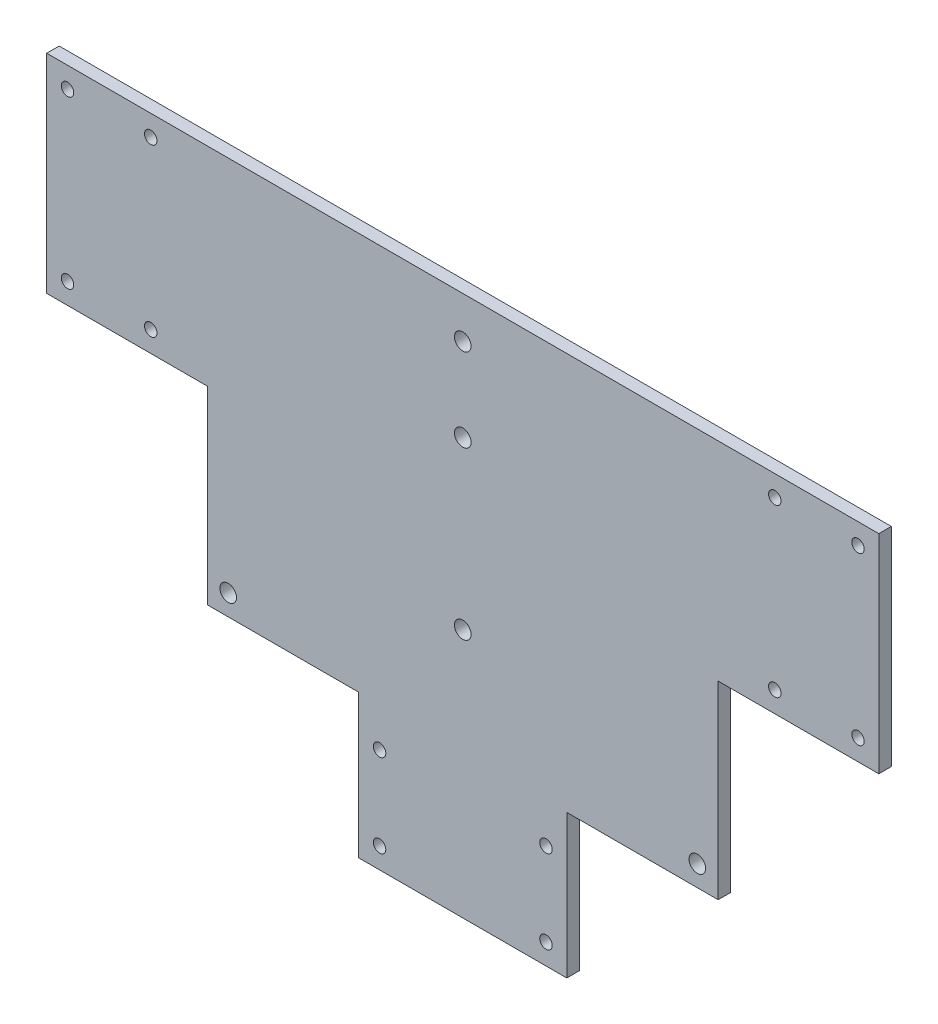
ISO-10303-21;
HEADER;
FILE_DESCRIPTION(('STEP AP214'),'2;1');
FILE_NAME('part.step','',(''),(''),'','','');
FILE_SCHEMA(('AUTOMOTIVE_DESIGN { 1 0 10303 214 1 1 1 1 }'));
ENDSEC;
DATA;
#1=APPLICATION_CONTEXT('core data for automotive mechanical design processes');
#2=APPLICATION_PROTOCOL_DEFINITION('international standard','automotive_design',2000,#1);
#3=PRODUCT_CONTEXT('',#1,'mechanical');
#4=PRODUCT('Part','Part','',(#3));
#5=PRODUCT_RELATED_PRODUCT_CATEGORY('part','',(#4));
#6=PRODUCT_DEFINITION_FORMATION('','',#4);
#7=PRODUCT_DEFINITION_CONTEXT('part definition',#1,'design');
#8=PRODUCT_DEFINITION('design','',#6,#7);
#9=PRODUCT_DEFINITION_SHAPE('','',#8);
#10=(LENGTH_UNIT() NAMED_UNIT(*) SI_UNIT(.MILLI.,.METRE.));
#11=(NAMED_UNIT(*) PLANE_ANGLE_UNIT() SI_UNIT($,.RADIAN.));
#12=(NAMED_UNIT(*) SI_UNIT($,.STERADIAN.) SOLID_ANGLE_UNIT());
#13=UNCERTAINTY_MEASURE_WITH_UNIT(LENGTH_MEASURE(1.E-05),#10,'distance_accuracy_value','');
#14=(GEOMETRIC_REPRESENTATION_CONTEXT(3) GLOBAL_UNCERTAINTY_ASSIGNED_CONTEXT((#13)) GLOBAL_UNIT_ASSIGNED_CONTEXT((#10,
#11,#12)) REPRESENTATION_CONTEXT('',''));
#15=CARTESIAN_POINT('',(0.,0.,0.));
#16=DIRECTION('',(0.,0.,1.));
#17=DIRECTION('',(1.,0.,0.));
#18=AXIS2_PLACEMENT_3D('',#15,#16,#17);
#19=CARTESIAN_POINT('',(100.,50.,3.));
#20=DIRECTION('',(0.,0.,-1.));
#21=DIRECTION('',(-1.,0.,0.));
#22=AXIS2_PLACEMENT_3D('',#19,#20,#21);
#23=PLANE('',#22);
#24=CARTESIAN_POINT('',(56.3815572471545,-40.5212085995402,3.));
#25=DIRECTION('',(0.,0.,1.));
#26=DIRECTION('',(-1.,0.,0.));
#27=AXIS2_PLACEMENT_3D('',#24,#25,#26);
#28=CIRCLE('',#27,2.00000000000002);
#29=CARTESIAN_POINT('',(54.3815572471545,-40.5212085995402,3.));
#30=VERTEX_POINT('',#29);
#31=EDGE_CURVE('E553',#30,#30,#28,.T.);
#32=ORIENTED_EDGE('',*,*,#31,.F.);
#33=EDGE_LOOP('',(#32));
#34=FACE_BOUND('',#33,.T.);
#35=CARTESIAN_POINT('',(75.,45.,3.));
#36=DIRECTION('',(0.,0.,1.));
#37=DIRECTION('',(1.,0.,0.));
#38=AXIS2_PLACEMENT_3D('',#35,#36,#37);
#39=CIRCLE('',#38,1.50000000000001);
#40=CARTESIAN_POINT('',(76.5,45.,3.));
#41=VERTEX_POINT('',#40);
#42=EDGE_CURVE('E565',#41,#41,#39,.T.);
#43=ORIENTED_EDGE('',*,*,#42,.F.);
#44=EDGE_LOOP('',(#43));
#45=FACE_BOUND('',#44,.T.);
#46=CARTESIAN_POINT('',(75.,5.,3.));
#47=DIRECTION('',(0.,0.,1.));
#48=DIRECTION('',(-1.,0.,0.));
#49=AXIS2_PLACEMENT_3D('',#46,#47,#48);
#50=CIRCLE('',#49,1.50000000000001);
#51=CARTESIAN_POINT('',(73.5,5.,3.));
#52=VERTEX_POINT('',#51);
#53=EDGE_CURVE('E577',#52,#52,#50,.T.);
#54=ORIENTED_EDGE('',*,*,#53,.F.);
#55=EDGE_LOOP('',(#54));
#56=FACE_BOUND('',#55,.T.);
#57=CARTESIAN_POINT('',(-75.,5.,3.));
#58=DIRECTION('',(0.,0.,1.));
#59=DIRECTION('',(1.,0.,0.));
#60=AXIS2_PLACEMENT_3D('',#57,#58,#59);
#61=CIRCLE('',#60,1.5);
#62=CARTESIAN_POINT('',(-73.5,5.,3.));
#63=VERTEX_POINT('',#62);
#64=EDGE_CURVE('E589',#63,#63,#61,.T.);
#65=ORIENTED_EDGE('',*,*,#64,.F.);
#66=EDGE_LOOP('',(#65));
#67=FACE_BOUND('',#66,.T.);
#68=CARTESIAN_POINT('',(-95.,45.,3.));
#69=DIRECTION('',(0.,0.,1.));
#70=DIRECTION('',(1.,0.,0.));
#71=AXIS2_PLACEMENT_3D('',#68,#69,#70);
#72=CIRCLE('',#71,1.5);
#73=CARTESIAN_POINT('',(-93.5,45.,3.));
#74=VERTEX_POINT('',#73);
#75=EDGE_CURVE('E601',#74,#74,#72,.T.);
#76=ORIENTED_EDGE('',*,*,#75,.F.);
#77=EDGE_LOOP('',(#76));
#78=FACE_BOUND('',#77,.T.);
#79=CARTESIAN_POINT('',(20.,-75.,3.));
#80=DIRECTION('',(0.,0.,1.));
#81=DIRECTION('',(1.,0.,0.));
#82=AXIS2_PLACEMENT_3D('',#79,#80,#81);
#83=CIRCLE('',#82,1.5);
#84=CARTESIAN_POINT('',(21.5,-75.,3.));
#85=VERTEX_POINT('',#84);
#86=EDGE_CURVE('E613',#85,#85,#83,.T.);
#87=ORIENTED_EDGE('',*,*,#86,.F.);
#88=EDGE_LOOP('',(#87));
#89=FACE_BOUND('',#88,.T.);
#90=CARTESIAN_POINT('',(-20.,-55.,3.));
#91=DIRECTION('',(0.,0.,1.));
#92=DIRECTION('',(1.,0.,0.));
#93=AXIS2_PLACEMENT_3D('',#90,#91,#92);
#94=CIRCLE('',#93,1.5);
#95=CARTESIAN_POINT('',(-18.5,-55.,3.));
#96=VERTEX_POINT('',#95);
#97=EDGE_CURVE('E625',#96,#96,#94,.T.);
#98=ORIENTED_EDGE('',*,*,#97,.F.);
#99=EDGE_LOOP('',(#98));
#100=FACE_BOUND('',#99,.T.);
#101=CARTESIAN_POINT('',(0.,-20.,3.));
#102=DIRECTION('',(0.,0.,1.));
#103=DIRECTION('',(1.,0.,0.));
#104=AXIS2_PLACEMENT_3D('',#101,#102,#103);
#105=CIRCLE('',#104,2.);
#106=CARTESIAN_POINT('',(2.,-20.,3.));
#107=VERTEX_POINT('',#106);
#108=EDGE_CURVE('E637',#107,#107,#105,.T.);
#109=ORIENTED_EDGE('',*,*,#108,.F.);
#110=EDGE_LOOP('',(#109));
#111=FACE_BOUND('',#110,.T.);
#112=DIRECTION('',(-1.,0.,0.));
#113=VECTOR('',#112,1.);
#114=CARTESIAN_POINT('',(0.,50.,3.));
#115=LINE('',#114,#113);
#116=CARTESIAN_POINT('',(100.,50.,3.));
#117=VERTEX_POINT('',#116);
#118=CARTESIAN_POINT('',(-100.,50.,3.));
#119=VERTEX_POINT('',#118);
#120=EDGE_CURVE('E102',#117,#119,#115,.T.);
#121=ORIENTED_EDGE('',*,*,#120,.T.);
#122=DIRECTION('',(0.,-1.,0.));
#123=VECTOR('',#122,1.);
#124=CARTESIAN_POINT('',(-100.,50.,3.));
#125=LINE('',#124,#123);
#126=CARTESIAN_POINT('',(-100.,0.,3.));
#127=VERTEX_POINT('',#126);
#128=EDGE_CURVE('E243',#119,#127,#125,.T.);
#129=ORIENTED_EDGE('',*,*,#128,.T.);
#130=DIRECTION('',(1.,0.,0.));
#131=VECTOR('',#130,1.);
#132=CARTESIAN_POINT('',(-100.,0.,3.));
#133=LINE('',#132,#131);
#134=CARTESIAN_POINT('',(-61.3815572471545,0.,3.));
#135=VERTEX_POINT('',#134);
#136=EDGE_CURVE('E202',#127,#135,#133,.T.);
#137=ORIENTED_EDGE('',*,*,#136,.T.);
#138=DIRECTION('',(0.,-1.,0.));
#139=VECTOR('',#138,1.);
#140=CARTESIAN_POINT('',(-61.3815572471545,0.,3.));
#141=LINE('',#140,#139);
#142=CARTESIAN_POINT('',(-61.3815572471545,-45.5212085995402,3.));
#143=VERTEX_POINT('',#142);
#144=EDGE_CURVE('E221',#135,#143,#141,.T.);
#145=ORIENTED_EDGE('',*,*,#144,.T.);
#146=DIRECTION('',(1.,0.,0.));
#147=VECTOR('',#146,1.);
#148=CARTESIAN_POINT('',(-61.3815572471545,-45.5212085995402,3.));
#149=LINE('',#148,#147);
#150=CARTESIAN_POINT('',(-25.,-45.5212085995402,3.));
#151=VERTEX_POINT('',#150);
#152=EDGE_CURVE('E218',#143,#151,#149,.T.);
#153=ORIENTED_EDGE('',*,*,#152,.T.);
#154=DIRECTION('',(0.,-1.,0.));
#155=VECTOR('',#154,1.);
#156=CARTESIAN_POINT('',(-25.,-80.,3.));
#157=LINE('',#156,#155);
#158=CARTESIAN_POINT('',(-25.,-80.,3.));
#159=VERTEX_POINT('',#158);
#160=EDGE_CURVE('E220',#151,#159,#157,.T.);
#161=ORIENTED_EDGE('',*,*,#160,.T.);
#162=DIRECTION('',(1.,0.,0.));
#163=VECTOR('',#162,1.);
#164=CARTESIAN_POINT('',(25.,-80.,3.));
#165=LINE('',#164,#163);
#166=CARTESIAN_POINT('',(25.,-80.,3.));
#167=VERTEX_POINT('',#166);
#168=EDGE_CURVE('E223',#159,#167,#165,.T.);
#169=ORIENTED_EDGE('',*,*,#168,.T.);
#170=DIRECTION('',(0.,1.,0.));
#171=VECTOR('',#170,1.);
#172=CARTESIAN_POINT('',(25.,-80.,3.));
#173=LINE('',#172,#171);
#174=CARTESIAN_POINT('',(25.,-45.5212085995402,3.));
#175=VERTEX_POINT('',#174);
#176=EDGE_CURVE('E229',#167,#175,#173,.T.);
#177=ORIENTED_EDGE('',*,*,#176,.T.);
#178=DIRECTION('',(1.,0.,0.));
#179=VECTOR('',#178,1.);
#180=CARTESIAN_POINT('',(61.3815572471545,-45.5212085995402,3.));
#181=LINE('',#180,#179);
#182=CARTESIAN_POINT('',(61.3815572471545,-45.5212085995402,3.));
#183=VERTEX_POINT('',#182);
#184=EDGE_CURVE('E134',#175,#183,#181,.T.);
#185=ORIENTED_EDGE('',*,*,#184,.T.);
#186=DIRECTION('',(0.,1.,0.));
#187=VECTOR('',#186,1.);
#188=CARTESIAN_POINT('',(61.3815572471545,0.,3.));
#189=LINE('',#188,#187);
#190=CARTESIAN_POINT('',(61.3815572471545,0.,3.));
#191=VERTEX_POINT('',#190);
#192=EDGE_CURVE('E128',#183,#191,#189,.T.);
#193=ORIENTED_EDGE('',*,*,#192,.T.);
#194=DIRECTION('',(1.,0.,0.));
#195=VECTOR('',#194,1.);
#196=CARTESIAN_POINT('',(100.,0.,3.));
#197=LINE('',#196,#195);
#198=CARTESIAN_POINT('',(100.,0.,3.));
#199=VERTEX_POINT('',#198);
#200=EDGE_CURVE('E132',#191,#199,#197,.T.);
#201=ORIENTED_EDGE('',*,*,#200,.T.);
#202=DIRECTION('',(0.,1.,0.));
#203=VECTOR('',#202,1.);
#204=CARTESIAN_POINT('',(100.,50.,3.));
#205=LINE('',#204,#203);
#206=EDGE_CURVE('E48',#199,#117,#205,.T.);
#207=ORIENTED_EDGE('',*,*,#206,.T.);
#208=EDGE_LOOP('',(#121,#129,#137,#145,#153,#161,#169,#177,#185,#193,#201,#207));
#209=FACE_BOUND('',#208,.T.);
#210=CARTESIAN_POINT('',(0.,20.,3.));
#211=DIRECTION('',(0.,0.,1.));
#212=DIRECTION('',(1.,0.,0.));
#213=AXIS2_PLACEMENT_3D('',#210,#211,#212);
#214=CIRCLE('',#213,2.);
#215=CARTESIAN_POINT('',(2.,20.,3.));
#216=VERTEX_POINT('',#215);
#217=EDGE_CURVE('E154',#216,#216,#214,.T.);
#218=ORIENTED_EDGE('',*,*,#217,.F.);
#219=EDGE_LOOP('',(#218));
#220=FACE_BOUND('',#219,.T.);
#221=CARTESIAN_POINT('',(0.,40.,3.));
#222=DIRECTION('',(0.,0.,1.));
#223=DIRECTION('',(1.,0.,0.));
#224=AXIS2_PLACEMENT_3D('',#221,#222,#223);
#225=CIRCLE('',#224,2.);
#226=CARTESIAN_POINT('',(1.99999999999999,40.,3.));
#227=VERTEX_POINT('',#226);
#228=EDGE_CURVE('E631',#227,#227,#225,.T.);
#229=ORIENTED_EDGE('',*,*,#228,.F.);
#230=EDGE_LOOP('',(#229));
#231=FACE_BOUND('',#230,.T.);
#232=CARTESIAN_POINT('',(20.,-55.,3.));
#233=DIRECTION('',(0.,0.,1.));
#234=DIRECTION('',(-1.,0.,0.));
#235=AXIS2_PLACEMENT_3D('',#232,#233,#234);
#236=CIRCLE('',#235,1.5);
#237=CARTESIAN_POINT('',(18.5,-55.,3.));
#238=VERTEX_POINT('',#237);
#239=EDGE_CURVE('E619',#238,#238,#236,.T.);
#240=ORIENTED_EDGE('',*,*,#239,.F.);
#241=EDGE_LOOP('',(#240));
#242=FACE_BOUND('',#241,.T.);
#243=CARTESIAN_POINT('',(-20.,-75.,3.));
#244=DIRECTION('',(0.,0.,1.));
#245=DIRECTION('',(-1.,0.,0.));
#246=AXIS2_PLACEMENT_3D('',#243,#244,#245);
#247=CIRCLE('',#246,1.5);
#248=CARTESIAN_POINT('',(-21.5,-75.,3.));
#249=VERTEX_POINT('',#248);
#250=EDGE_CURVE('E607',#249,#249,#247,.T.);
#251=ORIENTED_EDGE('',*,*,#250,.F.);
#252=EDGE_LOOP('',(#251));
#253=FACE_BOUND('',#252,.T.);
#254=CARTESIAN_POINT('',(-75.,45.,3.));
#255=DIRECTION('',(0.,0.,1.));
#256=DIRECTION('',(-1.,0.,0.));
#257=AXIS2_PLACEMENT_3D('',#254,#255,#256);
#258=CIRCLE('',#257,1.5);
#259=CARTESIAN_POINT('',(-76.5,45.,3.));
#260=VERTEX_POINT('',#259);
#261=EDGE_CURVE('E595',#260,#260,#258,.T.);
#262=ORIENTED_EDGE('',*,*,#261,.F.);
#263=EDGE_LOOP('',(#262));
#264=FACE_BOUND('',#263,.T.);
#265=CARTESIAN_POINT('',(-95.,5.,3.));
#266=DIRECTION('',(0.,0.,1.));
#267=DIRECTION('',(-1.,0.,0.));
#268=AXIS2_PLACEMENT_3D('',#265,#266,#267);
#269=CIRCLE('',#268,1.5);
#270=CARTESIAN_POINT('',(-96.5,5.,3.));
#271=VERTEX_POINT('',#270);
#272=EDGE_CURVE('E583',#271,#271,#269,.T.);
#273=ORIENTED_EDGE('',*,*,#272,.F.);
#274=EDGE_LOOP('',(#273));
#275=FACE_BOUND('',#274,.T.);
#276=CARTESIAN_POINT('',(95.,5.,3.));
#277=DIRECTION('',(0.,0.,1.));
#278=DIRECTION('',(1.,0.,0.));
#279=AXIS2_PLACEMENT_3D('',#276,#277,#278);
#280=CIRCLE('',#279,1.49999999999998);
#281=CARTESIAN_POINT('',(96.5,5.,3.));
#282=VERTEX_POINT('',#281);
#283=EDGE_CURVE('E571',#282,#282,#280,.T.);
#284=ORIENTED_EDGE('',*,*,#283,.F.);
#285=EDGE_LOOP('',(#284));
#286=FACE_BOUND('',#285,.T.);
#287=CARTESIAN_POINT('',(95.,45.,3.));
#288=DIRECTION('',(0.,0.,1.));
#289=DIRECTION('',(-1.,0.,0.));
#290=AXIS2_PLACEMENT_3D('',#287,#288,#289);
#291=CIRCLE('',#290,1.49999999999998);
#292=CARTESIAN_POINT('',(93.5,45.,3.));
#293=VERTEX_POINT('',#292);
#294=EDGE_CURVE('E559',#293,#293,#291,.T.);
#295=ORIENTED_EDGE('',*,*,#294,.F.);
#296=EDGE_LOOP('',(#295));
#297=FACE_BOUND('',#296,.T.);
#298=CARTESIAN_POINT('',(-56.3815572471545,-40.5212085995402,3.));
#299=DIRECTION('',(0.,0.,1.));
#300=DIRECTION('',(1.,0.,0.));
#301=AXIS2_PLACEMENT_3D('',#298,#299,#300);
#302=CIRCLE('',#301,2.);
#303=CARTESIAN_POINT('',(-54.3815572471545,-40.5212085995402,3.));
#304=VERTEX_POINT('',#303);
#305=EDGE_CURVE('E544',#304,#304,#302,.T.);
#306=ORIENTED_EDGE('',*,*,#305,.F.);
#307=EDGE_LOOP('',(#306));
#308=FACE_BOUND('',#307,.T.);
#309=ADVANCED_FACE('F31',(#34,#45,#56,#67,#78,#89,#100,#111,#209,#220,#231,#242,#253,#264,#275,
#286,#297,#308),#23,.F.);
#310=CARTESIAN_POINT('',(100.,50.,0.));
#311=DIRECTION('',(0.,0.,-1.));
#312=DIRECTION('',(-1.,0.,0.));
#313=AXIS2_PLACEMENT_3D('',#310,#311,#312);
#314=PLANE('',#313);
#315=CARTESIAN_POINT('',(56.3815572471545,-40.5212085995402,0.));
#316=DIRECTION('',(0.,0.,1.));
#317=DIRECTION('',(-1.,0.,0.));
#318=AXIS2_PLACEMENT_3D('',#315,#316,#317);
#319=CIRCLE('',#318,2.00000000000002);
#320=CARTESIAN_POINT('',(54.3815572471545,-40.5212085995402,0.));
#321=VERTEX_POINT('',#320);
#322=EDGE_CURVE('E550',#321,#321,#319,.T.);
#323=ORIENTED_EDGE('',*,*,#322,.T.);
#324=EDGE_LOOP('',(#323));
#325=FACE_BOUND('',#324,.T.);
#326=CARTESIAN_POINT('',(75.,45.,0.));
#327=DIRECTION('',(0.,0.,1.));
#328=DIRECTION('',(1.,0.,0.));
#329=AXIS2_PLACEMENT_3D('',#326,#327,#328);
#330=CIRCLE('',#329,1.50000000000001);
#331=CARTESIAN_POINT('',(76.5,45.,0.));
#332=VERTEX_POINT('',#331);
#333=EDGE_CURVE('E562',#332,#332,#330,.T.);
#334=ORIENTED_EDGE('',*,*,#333,.T.);
#335=EDGE_LOOP('',(#334));
#336=FACE_BOUND('',#335,.T.);
#337=CARTESIAN_POINT('',(75.,5.,0.));
#338=DIRECTION('',(0.,0.,1.));
#339=DIRECTION('',(-1.,0.,0.));
#340=AXIS2_PLACEMENT_3D('',#337,#338,#339);
#341=CIRCLE('',#340,1.50000000000001);
#342=CARTESIAN_POINT('',(73.5,5.,0.));
#343=VERTEX_POINT('',#342);
#344=EDGE_CURVE('E574',#343,#343,#341,.T.);
#345=ORIENTED_EDGE('',*,*,#344,.T.);
#346=EDGE_LOOP('',(#345));
#347=FACE_BOUND('',#346,.T.);
#348=CARTESIAN_POINT('',(-75.,5.,0.));
#349=DIRECTION('',(0.,0.,1.));
#350=DIRECTION('',(1.,0.,0.));
#351=AXIS2_PLACEMENT_3D('',#348,#349,#350);
#352=CIRCLE('',#351,1.5);
#353=CARTESIAN_POINT('',(-73.5,5.,0.));
#354=VERTEX_POINT('',#353);
#355=EDGE_CURVE('E586',#354,#354,#352,.T.);
#356=ORIENTED_EDGE('',*,*,#355,.T.);
#357=EDGE_LOOP('',(#356));
#358=FACE_BOUND('',#357,.T.);
#359=CARTESIAN_POINT('',(-95.,45.,0.));
#360=DIRECTION('',(0.,0.,1.));
#361=DIRECTION('',(1.,0.,0.));
#362=AXIS2_PLACEMENT_3D('',#359,#360,#361);
#363=CIRCLE('',#362,1.5);
#364=CARTESIAN_POINT('',(-93.5,45.,0.));
#365=VERTEX_POINT('',#364);
#366=EDGE_CURVE('E598',#365,#365,#363,.T.);
#367=ORIENTED_EDGE('',*,*,#366,.T.);
#368=EDGE_LOOP('',(#367));
#369=FACE_BOUND('',#368,.T.);
#370=CARTESIAN_POINT('',(20.,-75.,0.));
#371=DIRECTION('',(0.,0.,1.));
#372=DIRECTION('',(1.,0.,0.));
#373=AXIS2_PLACEMENT_3D('',#370,#371,#372);
#374=CIRCLE('',#373,1.5);
#375=CARTESIAN_POINT('',(21.5,-75.,0.));
#376=VERTEX_POINT('',#375);
#377=EDGE_CURVE('E610',#376,#376,#374,.T.);
#378=ORIENTED_EDGE('',*,*,#377,.T.);
#379=EDGE_LOOP('',(#378));
#380=FACE_BOUND('',#379,.T.);
#381=CARTESIAN_POINT('',(-20.,-55.,0.));
#382=DIRECTION('',(0.,0.,1.));
#383=DIRECTION('',(1.,0.,0.));
#384=AXIS2_PLACEMENT_3D('',#381,#382,#383);
#385=CIRCLE('',#384,1.5);
#386=CARTESIAN_POINT('',(-18.5,-55.,0.));
#387=VERTEX_POINT('',#386);
#388=EDGE_CURVE('E622',#387,#387,#385,.T.);
#389=ORIENTED_EDGE('',*,*,#388,.T.);
#390=EDGE_LOOP('',(#389));
#391=FACE_BOUND('',#390,.T.);
#392=CARTESIAN_POINT('',(0.,-20.,0.));
#393=DIRECTION('',(0.,0.,1.));
#394=DIRECTION('',(1.,0.,0.));
#395=AXIS2_PLACEMENT_3D('',#392,#393,#394);
#396=CIRCLE('',#395,2.);
#397=CARTESIAN_POINT('',(2.,-20.,0.));
#398=VERTEX_POINT('',#397);
#399=EDGE_CURVE('E634',#398,#398,#396,.T.);
#400=ORIENTED_EDGE('',*,*,#399,.T.);
#401=EDGE_LOOP('',(#400));
#402=FACE_BOUND('',#401,.T.);
#403=DIRECTION('',(-1.,0.,0.));
#404=VECTOR('',#403,1.);
#405=CARTESIAN_POINT('',(0.,50.,0.));
#406=LINE('',#405,#404);
#407=CARTESIAN_POINT('',(100.,50.,0.));
#408=VERTEX_POINT('',#407);
#409=CARTESIAN_POINT('',(-100.,50.,0.));
#410=VERTEX_POINT('',#409);
#411=EDGE_CURVE('E96',#408,#410,#406,.T.);
#412=ORIENTED_EDGE('',*,*,#411,.F.);
#413=DIRECTION('',(0.,1.,0.));
#414=VECTOR('',#413,1.);
#415=CARTESIAN_POINT('',(100.,50.,0.));
#416=LINE('',#415,#414);
#417=CARTESIAN_POINT('',(100.,0.,0.));
#418=VERTEX_POINT('',#417);
#419=EDGE_CURVE('E172',#418,#408,#416,.T.);
#420=ORIENTED_EDGE('',*,*,#419,.F.);
#421=DIRECTION('',(1.,0.,0.));
#422=VECTOR('',#421,1.);
#423=CARTESIAN_POINT('',(100.,0.,0.));
#424=LINE('',#423,#422);
#425=CARTESIAN_POINT('',(61.3815572471545,0.,0.));
#426=VERTEX_POINT('',#425);
#427=EDGE_CURVE('E89',#426,#418,#424,.T.);
#428=ORIENTED_EDGE('',*,*,#427,.F.);
#429=DIRECTION('',(0.,1.,0.));
#430=VECTOR('',#429,1.);
#431=CARTESIAN_POINT('',(61.3815572471545,0.,0.));
#432=LINE('',#431,#430);
#433=CARTESIAN_POINT('',(61.3815572471545,-45.5212085995402,0.));
#434=VERTEX_POINT('',#433);
#435=EDGE_CURVE('E142',#434,#426,#432,.T.);
#436=ORIENTED_EDGE('',*,*,#435,.F.);
#437=DIRECTION('',(1.,0.,0.));
#438=VECTOR('',#437,1.);
#439=CARTESIAN_POINT('',(61.3815572471545,-45.5212085995402,0.));
#440=LINE('',#439,#438);
#441=CARTESIAN_POINT('',(25.,-45.5212085995402,0.));
#442=VERTEX_POINT('',#441);
#443=EDGE_CURVE('E168',#442,#434,#440,.T.);
#444=ORIENTED_EDGE('',*,*,#443,.F.);
#445=DIRECTION('',(0.,1.,0.));
#446=VECTOR('',#445,1.);
#447=CARTESIAN_POINT('',(25.,-80.,0.));
#448=LINE('',#447,#446);
#449=CARTESIAN_POINT('',(25.,-80.,0.));
#450=VERTEX_POINT('',#449);
#451=EDGE_CURVE('E166',#450,#442,#448,.T.);
#452=ORIENTED_EDGE('',*,*,#451,.F.);
#453=DIRECTION('',(1.,0.,0.));
#454=VECTOR('',#453,1.);
#455=CARTESIAN_POINT('',(25.,-80.,0.));
#456=LINE('',#455,#454);
#457=CARTESIAN_POINT('',(-25.,-80.,0.));
#458=VERTEX_POINT('',#457);
#459=EDGE_CURVE('E164',#458,#450,#456,.T.);
#460=ORIENTED_EDGE('',*,*,#459,.F.);
#461=DIRECTION('',(0.,-1.,0.));
#462=VECTOR('',#461,1.);
#463=CARTESIAN_POINT('',(-25.,-80.,0.));
#464=LINE('',#463,#462);
#465=CARTESIAN_POINT('',(-25.,-45.5212085995402,0.));
#466=VERTEX_POINT('',#465);
#467=EDGE_CURVE('E162',#466,#458,#464,.T.);
#468=ORIENTED_EDGE('',*,*,#467,.F.);
#469=DIRECTION('',(1.,0.,0.));
#470=VECTOR('',#469,1.);
#471=CARTESIAN_POINT('',(-61.3815572471545,-45.5212085995402,0.));
#472=LINE('',#471,#470);
#473=CARTESIAN_POINT('',(-61.3815572471545,-45.5212085995402,0.));
#474=VERTEX_POINT('',#473);
#475=EDGE_CURVE('E160',#474,#466,#472,.T.);
#476=ORIENTED_EDGE('',*,*,#475,.F.);
#477=DIRECTION('',(0.,-1.,0.));
#478=VECTOR('',#477,1.);
#479=CARTESIAN_POINT('',(-61.3815572471545,0.,0.));
#480=LINE('',#479,#478);
#481=CARTESIAN_POINT('',(-61.3815572471545,0.,0.));
#482=VERTEX_POINT('',#481);
#483=EDGE_CURVE('E158',#482,#474,#480,.T.);
#484=ORIENTED_EDGE('',*,*,#483,.F.);
#485=DIRECTION('',(1.,0.,0.));
#486=VECTOR('',#485,1.);
#487=CARTESIAN_POINT('',(-100.,0.,0.));
#488=LINE('',#487,#486);
#489=CARTESIAN_POINT('',(-100.,0.,0.));
#490=VERTEX_POINT('',#489);
#491=EDGE_CURVE('E156',#490,#482,#488,.T.);
#492=ORIENTED_EDGE('',*,*,#491,.F.);
#493=DIRECTION('',(0.,-1.,0.));
#494=VECTOR('',#493,1.);
#495=CARTESIAN_POINT('',(-100.,50.,0.));
#496=LINE('',#495,#494);
#497=EDGE_CURVE('E153',#410,#490,#496,.T.);
#498=ORIENTED_EDGE('',*,*,#497,.F.);
#499=EDGE_LOOP('',(#412,#420,#428,#436,#444,#452,#460,#468,#476,#484,#492,#498));
#500=FACE_BOUND('',#499,.T.);
#501=CARTESIAN_POINT('',(0.,20.,0.));
#502=DIRECTION('',(0.,0.,1.));
#503=DIRECTION('',(1.,0.,0.));
#504=AXIS2_PLACEMENT_3D('',#501,#502,#503);
#505=CIRCLE('',#504,2.);
#506=CARTESIAN_POINT('',(2.,20.,0.));
#507=VERTEX_POINT('',#506);
#508=EDGE_CURVE('E247',#507,#507,#505,.T.);
#509=ORIENTED_EDGE('',*,*,#508,.T.);
#510=EDGE_LOOP('',(#509));
#511=FACE_BOUND('',#510,.T.);
#512=CARTESIAN_POINT('',(0.,40.,0.));
#513=DIRECTION('',(0.,0.,1.));
#514=DIRECTION('',(1.,0.,0.));
#515=AXIS2_PLACEMENT_3D('',#512,#513,#514);
#516=CIRCLE('',#515,2.);
#517=CARTESIAN_POINT('',(1.99999999999999,40.,0.));
#518=VERTEX_POINT('',#517);
#519=EDGE_CURVE('E628',#518,#518,#516,.T.);
#520=ORIENTED_EDGE('',*,*,#519,.T.);
#521=EDGE_LOOP('',(#520));
#522=FACE_BOUND('',#521,.T.);
#523=CARTESIAN_POINT('',(20.,-55.,0.));
#524=DIRECTION('',(0.,0.,1.));
#525=DIRECTION('',(-1.,0.,0.));
#526=AXIS2_PLACEMENT_3D('',#523,#524,#525);
#527=CIRCLE('',#526,1.5);
#528=CARTESIAN_POINT('',(18.5,-55.,0.));
#529=VERTEX_POINT('',#528);
#530=EDGE_CURVE('E616',#529,#529,#527,.T.);
#531=ORIENTED_EDGE('',*,*,#530,.T.);
#532=EDGE_LOOP('',(#531));
#533=FACE_BOUND('',#532,.T.);
#534=CARTESIAN_POINT('',(-20.,-75.,0.));
#535=DIRECTION('',(0.,0.,1.));
#536=DIRECTION('',(-1.,0.,0.));
#537=AXIS2_PLACEMENT_3D('',#534,#535,#536);
#538=CIRCLE('',#537,1.5);
#539=CARTESIAN_POINT('',(-21.5,-75.,0.));
#540=VERTEX_POINT('',#539);
#541=EDGE_CURVE('E604',#540,#540,#538,.T.);
#542=ORIENTED_EDGE('',*,*,#541,.T.);
#543=EDGE_LOOP('',(#542));
#544=FACE_BOUND('',#543,.T.);
#545=CARTESIAN_POINT('',(-75.,45.,0.));
#546=DIRECTION('',(0.,0.,1.));
#547=DIRECTION('',(-1.,0.,0.));
#548=AXIS2_PLACEMENT_3D('',#545,#546,#547);
#549=CIRCLE('',#548,1.5);
#550=CARTESIAN_POINT('',(-76.5,45.,0.));
#551=VERTEX_POINT('',#550);
#552=EDGE_CURVE('E592',#551,#551,#549,.T.);
#553=ORIENTED_EDGE('',*,*,#552,.T.);
#554=EDGE_LOOP('',(#553));
#555=FACE_BOUND('',#554,.T.);
#556=CARTESIAN_POINT('',(-95.,5.,0.));
#557=DIRECTION('',(0.,0.,1.));
#558=DIRECTION('',(-1.,0.,0.));
#559=AXIS2_PLACEMENT_3D('',#556,#557,#558);
#560=CIRCLE('',#559,1.5);
#561=CARTESIAN_POINT('',(-96.5,5.,0.));
#562=VERTEX_POINT('',#561);
#563=EDGE_CURVE('E580',#562,#562,#560,.T.);
#564=ORIENTED_EDGE('',*,*,#563,.T.);
#565=EDGE_LOOP('',(#564));
#566=FACE_BOUND('',#565,.T.);
#567=CARTESIAN_POINT('',(95.,5.,0.));
#568=DIRECTION('',(0.,0.,1.));
#569=DIRECTION('',(1.,0.,0.));
#570=AXIS2_PLACEMENT_3D('',#567,#568,#569);
#571=CIRCLE('',#570,1.49999999999998);
#572=CARTESIAN_POINT('',(96.5,5.,0.));
#573=VERTEX_POINT('',#572);
#574=EDGE_CURVE('E568',#573,#573,#571,.T.);
#575=ORIENTED_EDGE('',*,*,#574,.T.);
#576=EDGE_LOOP('',(#575));
#577=FACE_BOUND('',#576,.T.);
#578=CARTESIAN_POINT('',(95.,45.,0.));
#579=DIRECTION('',(0.,0.,1.));
#580=DIRECTION('',(-1.,0.,0.));
#581=AXIS2_PLACEMENT_3D('',#578,#579,#580);
#582=CIRCLE('',#581,1.49999999999998);
#583=CARTESIAN_POINT('',(93.5,45.,0.));
#584=VERTEX_POINT('',#583);
#585=EDGE_CURVE('E556',#584,#584,#582,.T.);
#586=ORIENTED_EDGE('',*,*,#585,.T.);
#587=EDGE_LOOP('',(#586));
#588=FACE_BOUND('',#587,.T.);
#589=CARTESIAN_POINT('',(-56.3815572471545,-40.5212085995402,0.));
#590=DIRECTION('',(0.,0.,1.));
#591=DIRECTION('',(1.,0.,0.));
#592=AXIS2_PLACEMENT_3D('',#589,#590,#591);
#593=CIRCLE('',#592,2.);
#594=CARTESIAN_POINT('',(-54.3815572471545,-40.5212085995402,0.));
#595=VERTEX_POINT('',#594);
#596=EDGE_CURVE('E547',#595,#595,#593,.T.);
#597=ORIENTED_EDGE('',*,*,#596,.T.);
#598=EDGE_LOOP('',(#597));
#599=FACE_BOUND('',#598,.T.);
#600=ADVANCED_FACE('F206',(#325,#336,#347,#358,#369,#380,#391,#402,#500,#511,#522,#533,#544,
#555,#566,#577,#588,#599),#314,.T.);
#601=CARTESIAN_POINT('',(0.,50.,3.));
#602=DIRECTION('',(0.,-1.,0.));
#603=DIRECTION('',(0.,0.,-1.));
#604=AXIS2_PLACEMENT_3D('',#601,#602,#603);
#605=PLANE('',#604);
#606=ORIENTED_EDGE('',*,*,#411,.T.);
#607=DIRECTION('',(0.,0.,-1.));
#608=VECTOR('',#607,1.);
#609=CARTESIAN_POINT('',(-100.,50.,3.));
#610=LINE('',#609,#608);
#611=EDGE_CURVE('E11',#119,#410,#610,.T.);
#612=ORIENTED_EDGE('',*,*,#611,.F.);
#613=ORIENTED_EDGE('',*,*,#120,.F.);
#614=DIRECTION('',(0.,0.,-1.));
#615=VECTOR('',#614,1.);
#616=CARTESIAN_POINT('',(100.,50.,3.));
#617=LINE('',#616,#615);
#618=EDGE_CURVE('E148',#117,#408,#617,.T.);
#619=ORIENTED_EDGE('',*,*,#618,.T.);
#620=EDGE_LOOP('',(#606,#612,#613,#619));
#621=FACE_BOUND('',#620,.T.);
#622=ADVANCED_FACE('F33',(#621),#605,.F.);
#623=CARTESIAN_POINT('',(-100.,50.,3.));
#624=DIRECTION('',(1.,0.,0.));
#625=DIRECTION('',(0.,0.,-1.));
#626=AXIS2_PLACEMENT_3D('',#623,#624,#625);
#627=PLANE('',#626);
#628=ORIENTED_EDGE('',*,*,#497,.T.);
#629=DIRECTION('',(0.,0.,-1.));
#630=VECTOR('',#629,1.);
#631=CARTESIAN_POINT('',(-100.,0.,3.));
#632=LINE('',#631,#630);
#633=EDGE_CURVE('E40',#127,#490,#632,.T.);
#634=ORIENTED_EDGE('',*,*,#633,.F.);
#635=ORIENTED_EDGE('',*,*,#128,.F.);
#636=ORIENTED_EDGE('',*,*,#611,.T.);
#637=EDGE_LOOP('',(#628,#634,#635,#636));
#638=FACE_BOUND('',#637,.T.);
#639=ADVANCED_FACE('F249',(#638),#627,.F.);
#640=CARTESIAN_POINT('',(-100.,0.,3.));
#641=DIRECTION('',(0.,1.,0.));
#642=DIRECTION('',(0.,0.,1.));
#643=AXIS2_PLACEMENT_3D('',#640,#641,#642);
#644=PLANE('',#643);
#645=ORIENTED_EDGE('',*,*,#491,.T.);
#646=DIRECTION('',(0.,0.,-1.));
#647=VECTOR('',#646,1.);
#648=CARTESIAN_POINT('',(-61.3815572471545,0.,3.));
#649=LINE('',#648,#647);
#650=EDGE_CURVE('E193',#135,#482,#649,.T.);
#651=ORIENTED_EDGE('',*,*,#650,.F.);
#652=ORIENTED_EDGE('',*,*,#136,.F.);
#653=ORIENTED_EDGE('',*,*,#633,.T.);
#654=EDGE_LOOP('',(#645,#651,#652,#653));
#655=FACE_BOUND('',#654,.T.);
#656=ADVANCED_FACE('F200',(#655),#644,.F.);
#657=CARTESIAN_POINT('',(-61.3815572471545,0.,3.));
#658=DIRECTION('',(1.,0.,0.));
#659=DIRECTION('',(0.,0.,-1.));
#660=AXIS2_PLACEMENT_3D('',#657,#658,#659);
#661=PLANE('',#660);
#662=ORIENTED_EDGE('',*,*,#483,.T.);
#663=DIRECTION('',(0.,0.,-1.));
#664=VECTOR('',#663,1.);
#665=CARTESIAN_POINT('',(-61.3815572471545,-45.5212085995402,3.));
#666=LINE('',#665,#664);
#667=EDGE_CURVE('E190',#143,#474,#666,.T.);
#668=ORIENTED_EDGE('',*,*,#667,.F.);
#669=ORIENTED_EDGE('',*,*,#144,.F.);
#670=ORIENTED_EDGE('',*,*,#650,.T.);
#671=EDGE_LOOP('',(#662,#668,#669,#670));
#672=FACE_BOUND('',#671,.T.);
#673=ADVANCED_FACE('F212',(#672),#661,.F.);
#674=CARTESIAN_POINT('',(-61.3815572471545,-45.5212085995402,3.));
#675=DIRECTION('',(0.,1.,0.));
#676=DIRECTION('',(0.,0.,1.));
#677=AXIS2_PLACEMENT_3D('',#674,#675,#676);
#678=PLANE('',#677);
#679=ORIENTED_EDGE('',*,*,#475,.T.);
#680=DIRECTION('',(0.,0.,-1.));
#681=VECTOR('',#680,1.);
#682=CARTESIAN_POINT('',(-25.,-45.5212085995402,3.));
#683=LINE('',#682,#681);
#684=EDGE_CURVE('E187',#151,#466,#683,.T.);
#685=ORIENTED_EDGE('',*,*,#684,.F.);
#686=ORIENTED_EDGE('',*,*,#152,.F.);
#687=ORIENTED_EDGE('',*,*,#667,.T.);
#688=EDGE_LOOP('',(#679,#685,#686,#687));
#689=FACE_BOUND('',#688,.T.);
#690=ADVANCED_FACE('F216',(#689),#678,.F.);
#691=CARTESIAN_POINT('',(-25.,-80.,3.));
#692=DIRECTION('',(1.,0.,0.));
#693=DIRECTION('',(0.,1.,0.));
#694=AXIS2_PLACEMENT_3D('',#691,#692,#693);
#695=PLANE('',#694);
#696=ORIENTED_EDGE('',*,*,#467,.T.);
#697=DIRECTION('',(0.,0.,-1.));
#698=VECTOR('',#697,1.);
#699=CARTESIAN_POINT('',(-25.,-80.,3.));
#700=LINE('',#699,#698);
#701=EDGE_CURVE('E184',#159,#458,#700,.T.);
#702=ORIENTED_EDGE('',*,*,#701,.F.);
#703=ORIENTED_EDGE('',*,*,#160,.F.);
#704=ORIENTED_EDGE('',*,*,#684,.T.);
#705=EDGE_LOOP('',(#696,#702,#703,#704));
#706=FACE_BOUND('',#705,.T.);
#707=ADVANCED_FACE('F283',(#706),#695,.F.);
#708=CARTESIAN_POINT('',(25.,-80.,3.));
#709=DIRECTION('',(0.,1.,0.));
#710=DIRECTION('',(0.,0.,1.));
#711=AXIS2_PLACEMENT_3D('',#708,#709,#710);
#712=PLANE('',#711);
#713=ORIENTED_EDGE('',*,*,#459,.T.);
#714=DIRECTION('',(0.,0.,-1.));
#715=VECTOR('',#714,1.);
#716=CARTESIAN_POINT('',(25.,-80.,3.));
#717=LINE('',#716,#715);
#718=EDGE_CURVE('E181',#167,#450,#717,.T.);
#719=ORIENTED_EDGE('',*,*,#718,.F.);
#720=ORIENTED_EDGE('',*,*,#168,.F.);
#721=ORIENTED_EDGE('',*,*,#701,.T.);
#722=EDGE_LOOP('',(#713,#719,#720,#721));
#723=FACE_BOUND('',#722,.T.);
#724=ADVANCED_FACE('F280',(#723),#712,.F.);
#725=CARTESIAN_POINT('',(25.,-80.,3.));
#726=DIRECTION('',(-1.,0.,0.));
#727=DIRECTION('',(0.,-1.,0.));
#728=AXIS2_PLACEMENT_3D('',#725,#726,#727);
#729=PLANE('',#728);
#730=ORIENTED_EDGE('',*,*,#451,.T.);
#731=DIRECTION('',(0.,0.,-1.));
#732=VECTOR('',#731,1.);
#733=CARTESIAN_POINT('',(25.,-45.5212085995402,3.));
#734=LINE('',#733,#732);
#735=EDGE_CURVE('E178',#175,#442,#734,.T.);
#736=ORIENTED_EDGE('',*,*,#735,.F.);
#737=ORIENTED_EDGE('',*,*,#176,.F.);
#738=ORIENTED_EDGE('',*,*,#718,.T.);
#739=EDGE_LOOP('',(#730,#736,#737,#738));
#740=FACE_BOUND('',#739,.T.);
#741=ADVANCED_FACE('F235',(#740),#729,.F.);
#742=CARTESIAN_POINT('',(61.3815572471545,-45.5212085995402,3.));
#743=DIRECTION('',(0.,1.,0.));
#744=DIRECTION('',(0.,0.,1.));
#745=AXIS2_PLACEMENT_3D('',#742,#743,#744);
#746=PLANE('',#745);
#747=ORIENTED_EDGE('',*,*,#443,.T.);
#748=DIRECTION('',(0.,0.,-1.));
#749=VECTOR('',#748,1.);
#750=CARTESIAN_POINT('',(61.3815572471545,-45.5212085995402,3.));
#751=LINE('',#750,#749);
#752=EDGE_CURVE('E143',#183,#434,#751,.T.);
#753=ORIENTED_EDGE('',*,*,#752,.F.);
#754=ORIENTED_EDGE('',*,*,#184,.F.);
#755=ORIENTED_EDGE('',*,*,#735,.T.);
#756=EDGE_LOOP('',(#747,#753,#754,#755));
#757=FACE_BOUND('',#756,.T.);
#758=ADVANCED_FACE('F239',(#757),#746,.F.);
#759=CARTESIAN_POINT('',(61.3815572471545,0.,3.));
#760=DIRECTION('',(-1.,0.,0.));
#761=DIRECTION('',(0.,0.,1.));
#762=AXIS2_PLACEMENT_3D('',#759,#760,#761);
#763=PLANE('',#762);
#764=ORIENTED_EDGE('',*,*,#435,.T.);
#765=DIRECTION('',(0.,0.,-1.));
#766=VECTOR('',#765,1.);
#767=CARTESIAN_POINT('',(61.3815572471545,0.,3.));
#768=LINE('',#767,#766);
#769=EDGE_CURVE('E139',#191,#426,#768,.T.);
#770=ORIENTED_EDGE('',*,*,#769,.F.);
#771=ORIENTED_EDGE('',*,*,#192,.F.);
#772=ORIENTED_EDGE('',*,*,#752,.T.);
#773=EDGE_LOOP('',(#764,#770,#771,#772));
#774=FACE_BOUND('',#773,.T.);
#775=ADVANCED_FACE('F140',(#774),#763,.F.);
#776=CARTESIAN_POINT('',(100.,0.,3.));
#777=DIRECTION('',(0.,1.,0.));
#778=DIRECTION('',(-1.,0.,0.));
#779=AXIS2_PLACEMENT_3D('',#776,#777,#778);
#780=PLANE('',#779);
#781=ORIENTED_EDGE('',*,*,#427,.T.);
#782=DIRECTION('',(0.,0.,-1.));
#783=VECTOR('',#782,1.);
#784=CARTESIAN_POINT('',(100.,0.,3.));
#785=LINE('',#784,#783);
#786=EDGE_CURVE('E144',#199,#418,#785,.T.);
#787=ORIENTED_EDGE('',*,*,#786,.F.);
#788=ORIENTED_EDGE('',*,*,#200,.F.);
#789=ORIENTED_EDGE('',*,*,#769,.T.);
#790=EDGE_LOOP('',(#781,#787,#788,#789));
#791=FACE_BOUND('',#790,.T.);
#792=ADVANCED_FACE('F146',(#791),#780,.F.);
#793=CARTESIAN_POINT('',(100.,50.,3.));
#794=DIRECTION('',(-1.,0.,0.));
#795=DIRECTION('',(0.,0.,1.));
#796=AXIS2_PLACEMENT_3D('',#793,#794,#795);
#797=PLANE('',#796);
#798=ORIENTED_EDGE('',*,*,#419,.T.);
#799=ORIENTED_EDGE('',*,*,#618,.F.);
#800=ORIENTED_EDGE('',*,*,#206,.F.);
#801=ORIENTED_EDGE('',*,*,#786,.T.);
#802=EDGE_LOOP('',(#798,#799,#800,#801));
#803=FACE_BOUND('',#802,.T.);
#804=ADVANCED_FACE('F241',(#803),#797,.F.);
#805=CARTESIAN_POINT('',(0.,20.,3.));
#806=DIRECTION('',(0.,0.,-1.));
#807=DIRECTION('',(-1.,0.,0.));
#808=AXIS2_PLACEMENT_3D('',#805,#806,#807);
#809=CYLINDRICAL_SURFACE('',#808,2.);
#810=ORIENTED_EDGE('',*,*,#217,.T.);
#811=EDGE_LOOP('',(#810));
#812=FACE_BOUND('',#811,.T.);
#813=ORIENTED_EDGE('',*,*,#508,.F.);
#814=EDGE_LOOP('',(#813));
#815=FACE_BOUND('',#814,.T.);
#816=ADVANCED_FACE('F267',(#812,#815),#809,.F.);
#817=CARTESIAN_POINT('',(0.,-20.,3.));
#818=DIRECTION('',(0.,0.,-1.));
#819=DIRECTION('',(-1.,0.,0.));
#820=AXIS2_PLACEMENT_3D('',#817,#818,#819);
#821=CYLINDRICAL_SURFACE('',#820,2.);
#822=ORIENTED_EDGE('',*,*,#108,.T.);
#823=EDGE_LOOP('',(#822));
#824=FACE_BOUND('',#823,.T.);
#825=ORIENTED_EDGE('',*,*,#399,.F.);
#826=EDGE_LOOP('',(#825));
#827=FACE_BOUND('',#826,.T.);
#828=ADVANCED_FACE('F333',(#824,#827),#821,.F.);
#829=CARTESIAN_POINT('',(0.,40.,3.));
#830=DIRECTION('',(0.,0.,-1.));
#831=DIRECTION('',(-1.,0.,0.));
#832=AXIS2_PLACEMENT_3D('',#829,#830,#831);
#833=CYLINDRICAL_SURFACE('',#832,2.);
#834=ORIENTED_EDGE('',*,*,#228,.T.);
#835=EDGE_LOOP('',(#834));
#836=FACE_BOUND('',#835,.T.);
#837=ORIENTED_EDGE('',*,*,#519,.F.);
#838=EDGE_LOOP('',(#837));
#839=FACE_BOUND('',#838,.T.);
#840=ADVANCED_FACE('F340',(#836,#839),#833,.F.);
#841=CARTESIAN_POINT('',(-20.,-55.,3.));
#842=DIRECTION('',(0.,0.,-1.));
#843=DIRECTION('',(-1.,0.,0.));
#844=AXIS2_PLACEMENT_3D('',#841,#842,#843);
#845=CYLINDRICAL_SURFACE('',#844,1.5);
#846=ORIENTED_EDGE('',*,*,#97,.T.);
#847=EDGE_LOOP('',(#846));
#848=FACE_BOUND('',#847,.T.);
#849=ORIENTED_EDGE('',*,*,#388,.F.);
#850=EDGE_LOOP('',(#849));
#851=FACE_BOUND('',#850,.T.);
#852=ADVANCED_FACE('F347',(#848,#851),#845,.F.);
#853=CARTESIAN_POINT('',(20.,-55.,3.));
#854=DIRECTION('',(0.,0.,-1.));
#855=DIRECTION('',(-1.,0.,0.));
#856=AXIS2_PLACEMENT_3D('',#853,#854,#855);
#857=CYLINDRICAL_SURFACE('',#856,1.5);
#858=ORIENTED_EDGE('',*,*,#239,.T.);
#859=EDGE_LOOP('',(#858));
#860=FACE_BOUND('',#859,.T.);
#861=ORIENTED_EDGE('',*,*,#530,.F.);
#862=EDGE_LOOP('',(#861));
#863=FACE_BOUND('',#862,.T.);
#864=ADVANCED_FACE('F355',(#860,#863),#857,.F.);
#865=CARTESIAN_POINT('',(20.,-75.,3.));
#866=DIRECTION('',(0.,0.,-1.));
#867=DIRECTION('',(-1.,0.,0.));
#868=AXIS2_PLACEMENT_3D('',#865,#866,#867);
#869=CYLINDRICAL_SURFACE('',#868,1.5);
#870=ORIENTED_EDGE('',*,*,#86,.T.);
#871=EDGE_LOOP('',(#870));
#872=FACE_BOUND('',#871,.T.);
#873=ORIENTED_EDGE('',*,*,#377,.F.);
#874=EDGE_LOOP('',(#873));
#875=FACE_BOUND('',#874,.T.);
#876=ADVANCED_FACE('F363',(#872,#875),#869,.F.);
#877=CARTESIAN_POINT('',(-20.,-75.,3.));
#878=DIRECTION('',(0.,0.,-1.));
#879=DIRECTION('',(-1.,0.,0.));
#880=AXIS2_PLACEMENT_3D('',#877,#878,#879);
#881=CYLINDRICAL_SURFACE('',#880,1.5);
#882=ORIENTED_EDGE('',*,*,#250,.T.);
#883=EDGE_LOOP('',(#882));
#884=FACE_BOUND('',#883,.T.);
#885=ORIENTED_EDGE('',*,*,#541,.F.);
#886=EDGE_LOOP('',(#885));
#887=FACE_BOUND('',#886,.T.);
#888=ADVANCED_FACE('F371',(#884,#887),#881,.F.);
#889=CARTESIAN_POINT('',(-95.,45.,3.));
#890=DIRECTION('',(0.,0.,-1.));
#891=DIRECTION('',(-1.,0.,0.));
#892=AXIS2_PLACEMENT_3D('',#889,#890,#891);
#893=CYLINDRICAL_SURFACE('',#892,1.5);
#894=ORIENTED_EDGE('',*,*,#75,.T.);
#895=EDGE_LOOP('',(#894));
#896=FACE_BOUND('',#895,.T.);
#897=ORIENTED_EDGE('',*,*,#366,.F.);
#898=EDGE_LOOP('',(#897));
#899=FACE_BOUND('',#898,.T.);
#900=ADVANCED_FACE('F379',(#896,#899),#893,.F.);
#901=CARTESIAN_POINT('',(-75.,45.,3.));
#902=DIRECTION('',(0.,0.,-1.));
#903=DIRECTION('',(-1.,0.,0.));
#904=AXIS2_PLACEMENT_3D('',#901,#902,#903);
#905=CYLINDRICAL_SURFACE('',#904,1.5);
#906=ORIENTED_EDGE('',*,*,#261,.T.);
#907=EDGE_LOOP('',(#906));
#908=FACE_BOUND('',#907,.T.);
#909=ORIENTED_EDGE('',*,*,#552,.F.);
#910=EDGE_LOOP('',(#909));
#911=FACE_BOUND('',#910,.T.);
#912=ADVANCED_FACE('F387',(#908,#911),#905,.F.);
#913=CARTESIAN_POINT('',(-75.,5.,3.));
#914=DIRECTION('',(0.,0.,-1.));
#915=DIRECTION('',(-1.,0.,0.));
#916=AXIS2_PLACEMENT_3D('',#913,#914,#915);
#917=CYLINDRICAL_SURFACE('',#916,1.5);
#918=ORIENTED_EDGE('',*,*,#64,.T.);
#919=EDGE_LOOP('',(#918));
#920=FACE_BOUND('',#919,.T.);
#921=ORIENTED_EDGE('',*,*,#355,.F.);
#922=EDGE_LOOP('',(#921));
#923=FACE_BOUND('',#922,.T.);
#924=ADVANCED_FACE('F395',(#920,#923),#917,.F.);
#925=CARTESIAN_POINT('',(-95.,5.,3.));
#926=DIRECTION('',(0.,0.,-1.));
#927=DIRECTION('',(-1.,0.,0.));
#928=AXIS2_PLACEMENT_3D('',#925,#926,#927);
#929=CYLINDRICAL_SURFACE('',#928,1.5);
#930=ORIENTED_EDGE('',*,*,#272,.T.);
#931=EDGE_LOOP('',(#930));
#932=FACE_BOUND('',#931,.T.);
#933=ORIENTED_EDGE('',*,*,#563,.F.);
#934=EDGE_LOOP('',(#933));
#935=FACE_BOUND('',#934,.T.);
#936=ADVANCED_FACE('F403',(#932,#935),#929,.F.);
#937=CARTESIAN_POINT('',(75.,5.,3.));
#938=DIRECTION('',(0.,0.,-1.));
#939=DIRECTION('',(-1.,0.,0.));
#940=AXIS2_PLACEMENT_3D('',#937,#938,#939);
#941=CYLINDRICAL_SURFACE('',#940,1.50000000000001);
#942=ORIENTED_EDGE('',*,*,#53,.T.);
#943=EDGE_LOOP('',(#942));
#944=FACE_BOUND('',#943,.T.);
#945=ORIENTED_EDGE('',*,*,#344,.F.);
#946=EDGE_LOOP('',(#945));
#947=FACE_BOUND('',#946,.T.);
#948=ADVANCED_FACE('F411',(#944,#947),#941,.F.);
#949=CARTESIAN_POINT('',(95.,5.,3.));
#950=DIRECTION('',(0.,0.,-1.));
#951=DIRECTION('',(-1.,0.,0.));
#952=AXIS2_PLACEMENT_3D('',#949,#950,#951);
#953=CYLINDRICAL_SURFACE('',#952,1.49999999999998);
#954=ORIENTED_EDGE('',*,*,#283,.T.);
#955=EDGE_LOOP('',(#954));
#956=FACE_BOUND('',#955,.T.);
#957=ORIENTED_EDGE('',*,*,#574,.F.);
#958=EDGE_LOOP('',(#957));
#959=FACE_BOUND('',#958,.T.);
#960=ADVANCED_FACE('F419',(#956,#959),#953,.F.);
#961=CARTESIAN_POINT('',(75.,45.,3.));
#962=DIRECTION('',(0.,0.,-1.));
#963=DIRECTION('',(-1.,0.,0.));
#964=AXIS2_PLACEMENT_3D('',#961,#962,#963);
#965=CYLINDRICAL_SURFACE('',#964,1.50000000000001);
#966=ORIENTED_EDGE('',*,*,#42,.T.);
#967=EDGE_LOOP('',(#966));
#968=FACE_BOUND('',#967,.T.);
#969=ORIENTED_EDGE('',*,*,#333,.F.);
#970=EDGE_LOOP('',(#969));
#971=FACE_BOUND('',#970,.T.);
#972=ADVANCED_FACE('F427',(#968,#971),#965,.F.);
#973=CARTESIAN_POINT('',(95.,45.,3.));
#974=DIRECTION('',(0.,0.,-1.));
#975=DIRECTION('',(-1.,0.,0.));
#976=AXIS2_PLACEMENT_3D('',#973,#974,#975);
#977=CYLINDRICAL_SURFACE('',#976,1.49999999999998);
#978=ORIENTED_EDGE('',*,*,#294,.T.);
#979=EDGE_LOOP('',(#978));
#980=FACE_BOUND('',#979,.T.);
#981=ORIENTED_EDGE('',*,*,#585,.F.);
#982=EDGE_LOOP('',(#981));
#983=FACE_BOUND('',#982,.T.);
#984=ADVANCED_FACE('F435',(#980,#983),#977,.F.);
#985=CARTESIAN_POINT('',(56.3815572471545,-40.5212085995402,3.));
#986=DIRECTION('',(0.,0.,-1.));
#987=DIRECTION('',(-1.,0.,0.));
#988=AXIS2_PLACEMENT_3D('',#985,#986,#987);
#989=CYLINDRICAL_SURFACE('',#988,2.00000000000002);
#990=ORIENTED_EDGE('',*,*,#31,.T.);
#991=EDGE_LOOP('',(#990));
#992=FACE_BOUND('',#991,.T.);
#993=ORIENTED_EDGE('',*,*,#322,.F.);
#994=EDGE_LOOP('',(#993));
#995=FACE_BOUND('',#994,.T.);
#996=ADVANCED_FACE('F443',(#992,#995),#989,.F.);
#997=CARTESIAN_POINT('',(-56.3815572471545,-40.5212085995402,3.));
#998=DIRECTION('',(0.,0.,-1.));
#999=DIRECTION('',(-1.,0.,0.));
#1000=AXIS2_PLACEMENT_3D('',#997,#998,#999);
#1001=CYLINDRICAL_SURFACE('',#1000,2.);
#1002=ORIENTED_EDGE('',*,*,#305,.T.);
#1003=EDGE_LOOP('',(#1002));
#1004=FACE_BOUND('',#1003,.T.);
#1005=ORIENTED_EDGE('',*,*,#596,.F.);
#1006=EDGE_LOOP('',(#1005));
#1007=FACE_BOUND('',#1006,.T.);
#1008=ADVANCED_FACE('F451',(#1004,#1007),#1001,.F.);
#1009=CLOSED_SHELL('',(#309,#600,#622,#639,#656,#673,#690,#707,#724,#741,#758,#775,#792,#804,
#816,#828,#840,#852,#864,#876,#888,#900,#912,#924,#936,#948,#960,#972,#984,#996,#1008));
#1010=MANIFOLD_SOLID_BREP('B2',#1009);
#1011=ADVANCED_BREP_SHAPE_REPRESENTATION('',(#18,#1010),#14);
#1012=SHAPE_DEFINITION_REPRESENTATION(#9,#1011);
ENDSEC;
END-ISO-10303-21;
